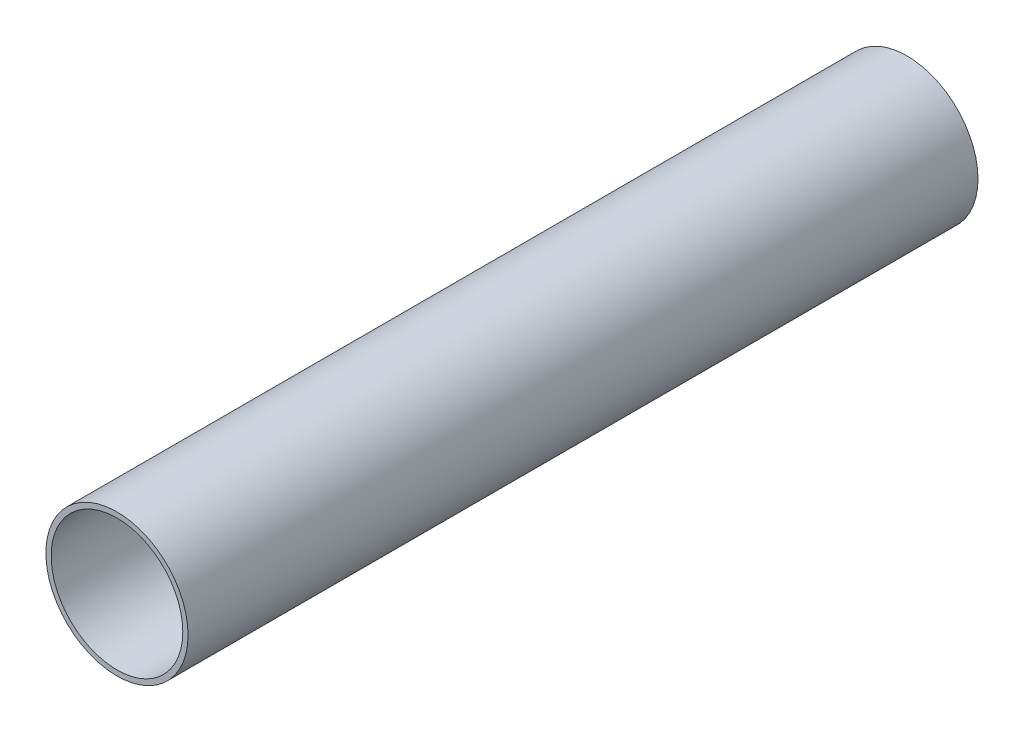
ISO-10303-21;
HEADER;
FILE_DESCRIPTION(('STEP AP214'),'2;1');
FILE_NAME('part.step','',(''),(''),'','','');
FILE_SCHEMA(('AUTOMOTIVE_DESIGN { 1 0 10303 214 1 1 1 1 }'));
ENDSEC;
DATA;
#1=APPLICATION_CONTEXT('core data for automotive mechanical design processes');
#2=APPLICATION_PROTOCOL_DEFINITION('international standard','automotive_design',2000,#1);
#3=PRODUCT_CONTEXT('',#1,'mechanical');
#4=PRODUCT('Part','Part','',(#3));
#5=PRODUCT_RELATED_PRODUCT_CATEGORY('part','',(#4));
#6=PRODUCT_DEFINITION_FORMATION('','',#4);
#7=PRODUCT_DEFINITION_CONTEXT('part definition',#1,'design');
#8=PRODUCT_DEFINITION('design','',#6,#7);
#9=PRODUCT_DEFINITION_SHAPE('','',#8);
#10=(LENGTH_UNIT() NAMED_UNIT(*) SI_UNIT(.MILLI.,.METRE.));
#11=(NAMED_UNIT(*) PLANE_ANGLE_UNIT() SI_UNIT($,.RADIAN.));
#12=(NAMED_UNIT(*) SI_UNIT($,.STERADIAN.) SOLID_ANGLE_UNIT());
#13=UNCERTAINTY_MEASURE_WITH_UNIT(LENGTH_MEASURE(1.E-05),#10,'distance_accuracy_value','');
#14=(GEOMETRIC_REPRESENTATION_CONTEXT(3) GLOBAL_UNCERTAINTY_ASSIGNED_CONTEXT((#13)) GLOBAL_UNIT_ASSIGNED_CONTEXT((#10,
#11,#12)) REPRESENTATION_CONTEXT('',''));
#15=CARTESIAN_POINT('',(0.,0.,0.));
#16=DIRECTION('',(0.,0.,1.));
#17=DIRECTION('',(1.,0.,0.));
#18=AXIS2_PLACEMENT_3D('',#15,#16,#17);
#19=CARTESIAN_POINT('',(0.,0.,152.4));
#20=DIRECTION('',(0.,0.,-1.));
#21=DIRECTION('',(-1.,0.,0.));
#22=AXIS2_PLACEMENT_3D('',#19,#20,#21);
#23=CYLINDRICAL_SURFACE('',#22,27.432);
#24=CARTESIAN_POINT('',(0.,0.,152.4));
#25=DIRECTION('',(0.,0.,1.));
#26=DIRECTION('',(1.,0.,0.));
#27=AXIS2_PLACEMENT_3D('',#24,#25,#26);
#28=CIRCLE('',#27,27.432);
#29=CARTESIAN_POINT('',(27.432,0.,152.4));
#30=VERTEX_POINT('',#29);
#31=EDGE_CURVE('E10',#30,#30,#28,.T.);
#32=ORIENTED_EDGE('',*,*,#31,.F.);
#33=EDGE_LOOP('',(#32));
#34=FACE_BOUND('',#33,.T.);
#35=CARTESIAN_POINT('',(0.,0.,-152.4));
#36=DIRECTION('',(0.,0.,1.));
#37=DIRECTION('',(1.,0.,0.));
#38=AXIS2_PLACEMENT_3D('',#35,#36,#37);
#39=CIRCLE('',#38,27.432);
#40=CARTESIAN_POINT('',(27.432,0.,-152.4));
#41=VERTEX_POINT('',#40);
#42=EDGE_CURVE('E36',#41,#41,#39,.T.);
#43=ORIENTED_EDGE('',*,*,#42,.T.);
#44=EDGE_LOOP('',(#43));
#45=FACE_BOUND('',#44,.T.);
#46=ADVANCED_FACE('F33',(#34,#45),#23,.T.);
#47=CARTESIAN_POINT('',(0.,0.,152.4));
#48=DIRECTION('',(0.,0.,1.));
#49=DIRECTION('',(1.,0.,0.));
#50=AXIS2_PLACEMENT_3D('',#47,#48,#49);
#51=PLANE('',#50);
#52=CARTESIAN_POINT('',(0.,0.,152.4));
#53=DIRECTION('',(0.,0.,1.));
#54=DIRECTION('',(1.,0.,0.));
#55=AXIS2_PLACEMENT_3D('',#52,#53,#54);
#56=CIRCLE('',#55,25.4);
#57=CARTESIAN_POINT('',(25.4,0.,152.4));
#58=VERTEX_POINT('',#57);
#59=EDGE_CURVE('E45',#58,#58,#56,.T.);
#60=ORIENTED_EDGE('',*,*,#59,.F.);
#61=EDGE_LOOP('',(#60));
#62=FACE_BOUND('',#61,.T.);
#63=ORIENTED_EDGE('',*,*,#31,.T.);
#64=EDGE_LOOP('',(#63));
#65=FACE_BOUND('',#64,.T.);
#66=ADVANCED_FACE('F60',(#62,#65),#51,.T.);
#67=CARTESIAN_POINT('',(0.,0.,-152.4));
#68=DIRECTION('',(0.,0.,1.));
#69=DIRECTION('',(1.,0.,0.));
#70=AXIS2_PLACEMENT_3D('',#67,#68,#69);
#71=PLANE('',#70);
#72=CARTESIAN_POINT('',(0.,0.,-152.4));
#73=DIRECTION('',(0.,0.,1.));
#74=DIRECTION('',(1.,0.,0.));
#75=AXIS2_PLACEMENT_3D('',#72,#73,#74);
#76=CIRCLE('',#75,25.4);
#77=CARTESIAN_POINT('',(25.4,0.,-152.4));
#78=VERTEX_POINT('',#77);
#79=EDGE_CURVE('E43',#78,#78,#76,.T.);
#80=ORIENTED_EDGE('',*,*,#79,.T.);
#81=EDGE_LOOP('',(#80));
#82=FACE_BOUND('',#81,.T.);
#83=ORIENTED_EDGE('',*,*,#42,.F.);
#84=EDGE_LOOP('',(#83));
#85=FACE_BOUND('',#84,.T.);
#86=ADVANCED_FACE('F51',(#82,#85),#71,.F.);
#87=CARTESIAN_POINT('',(0.,0.,-152.4));
#88=DIRECTION('',(0.,0.,1.));
#89=DIRECTION('',(1.,0.,0.));
#90=AXIS2_PLACEMENT_3D('',#87,#88,#89);
#91=CYLINDRICAL_SURFACE('',#90,25.4);
#92=ORIENTED_EDGE('',*,*,#79,.F.);
#93=EDGE_LOOP('',(#92));
#94=FACE_BOUND('',#93,.T.);
#95=ORIENTED_EDGE('',*,*,#59,.T.);
#96=EDGE_LOOP('',(#95));
#97=FACE_BOUND('',#96,.T.);
#98=ADVANCED_FACE('F54',(#94,#97),#91,.F.);
#99=CLOSED_SHELL('',(#46,#66,#86,#98));
#100=MANIFOLD_SOLID_BREP('B2',#99);
#101=ADVANCED_BREP_SHAPE_REPRESENTATION('',(#18,#100),#14);
#102=SHAPE_DEFINITION_REPRESENTATION(#9,#101);
ENDSEC;
END-ISO-10303-21;
